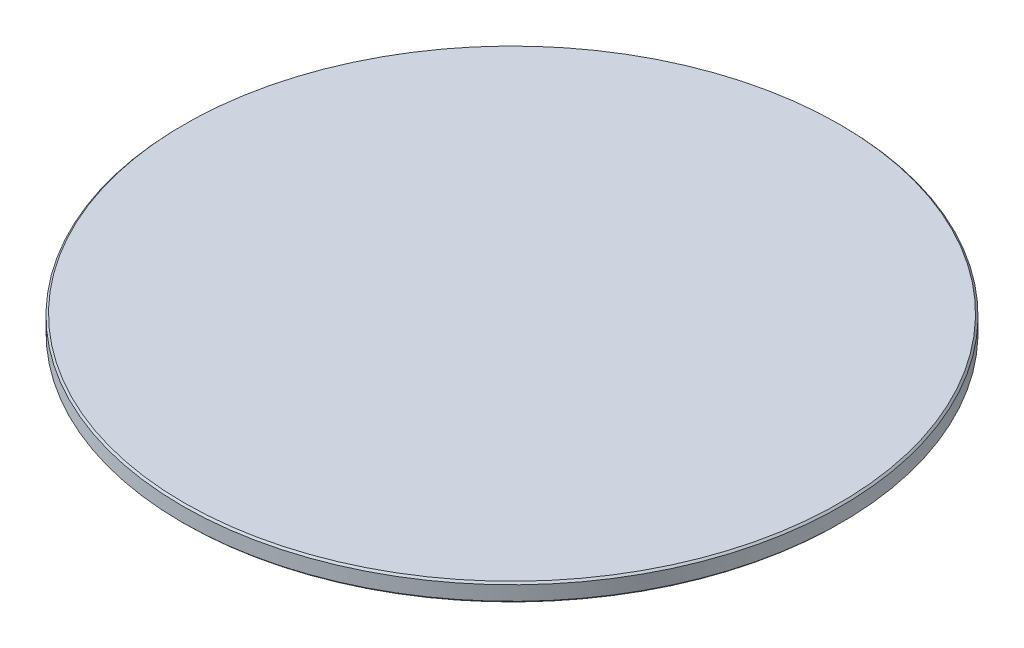
ISO-10303-21;
HEADER;
FILE_DESCRIPTION(('STEP AP214'),'2;1');
FILE_NAME('part.step','',(''),(''),'','','');
FILE_SCHEMA(('AUTOMOTIVE_DESIGN { 1 0 10303 214 1 1 1 1 }'));
ENDSEC;
DATA;
#1=APPLICATION_CONTEXT('core data for automotive mechanical design processes');
#2=APPLICATION_PROTOCOL_DEFINITION('international standard','automotive_design',2000,#1);
#3=PRODUCT_CONTEXT('',#1,'mechanical');
#4=PRODUCT('Part','Part','',(#3));
#5=PRODUCT_RELATED_PRODUCT_CATEGORY('part','',(#4));
#6=PRODUCT_DEFINITION_FORMATION('','',#4);
#7=PRODUCT_DEFINITION_CONTEXT('part definition',#1,'design');
#8=PRODUCT_DEFINITION('design','',#6,#7);
#9=PRODUCT_DEFINITION_SHAPE('','',#8);
#10=(LENGTH_UNIT() NAMED_UNIT(*) SI_UNIT(.MILLI.,.METRE.));
#11=(NAMED_UNIT(*) PLANE_ANGLE_UNIT() SI_UNIT($,.RADIAN.));
#12=(NAMED_UNIT(*) SI_UNIT($,.STERADIAN.) SOLID_ANGLE_UNIT());
#13=UNCERTAINTY_MEASURE_WITH_UNIT(LENGTH_MEASURE(1.E-05),#10,'distance_accuracy_value','');
#14=(GEOMETRIC_REPRESENTATION_CONTEXT(3) GLOBAL_UNCERTAINTY_ASSIGNED_CONTEXT((#13)) GLOBAL_UNIT_ASSIGNED_CONTEXT((#10,
#11,#12)) REPRESENTATION_CONTEXT('',''));
#15=CARTESIAN_POINT('',(0.,0.,0.));
#16=DIRECTION('',(0.,0.,1.));
#17=DIRECTION('',(1.,0.,0.));
#18=AXIS2_PLACEMENT_3D('',#15,#16,#17);
#19=CARTESIAN_POINT('',(0.,0.,0.));
#20=DIRECTION('',(0.,1.,0.));
#21=DIRECTION('',(0.,0.,1.));
#22=AXIS2_PLACEMENT_3D('',#19,#20,#21);
#23=PLANE('',#22);
#24=CARTESIAN_POINT('',(0.,0.,0.));
#25=DIRECTION('',(0.,1.,0.));
#26=DIRECTION('',(0.,0.,1.));
#27=AXIS2_PLACEMENT_3D('',#24,#25,#26);
#28=CIRCLE('',#27,91.5);
#29=CARTESIAN_POINT('',(0.,0.,91.5));
#30=VERTEX_POINT('',#29);
#31=EDGE_CURVE('E66',#30,#30,#28,.T.);
#32=ORIENTED_EDGE('',*,*,#31,.T.);
#33=EDGE_LOOP('',(#32));
#34=FACE_BOUND('',#33,.T.);
#35=ADVANCED_FACE('F31',(#34),#23,.T.);
#36=CARTESIAN_POINT('',(0.,-1.2,0.));
#37=DIRECTION('',(0.,-1.,0.));
#38=DIRECTION('',(0.,0.,-1.));
#39=AXIS2_PLACEMENT_3D('',#36,#37,#38);
#40=CYLINDRICAL_SURFACE('',#39,92.);
#41=CARTESIAN_POINT('',(0.,-0.5,0.));
#42=DIRECTION('',(0.,1.,0.));
#43=DIRECTION('',(0.,0.,1.));
#44=AXIS2_PLACEMENT_3D('',#41,#42,#43);
#45=CIRCLE('',#44,92.);
#46=CARTESIAN_POINT('',(0.,-0.5,92.));
#47=VERTEX_POINT('',#46);
#48=EDGE_CURVE('E69',#47,#47,#45,.F.);
#49=ORIENTED_EDGE('',*,*,#48,.T.);
#50=EDGE_LOOP('',(#49));
#51=FACE_BOUND('',#50,.T.);
#52=CARTESIAN_POINT('',(0.,-4.49999999999998,0.));
#53=DIRECTION('',(0.,-1.,0.));
#54=DIRECTION('',(0.,0.,-1.));
#55=AXIS2_PLACEMENT_3D('',#52,#53,#54);
#56=CIRCLE('',#55,92.);
#57=CARTESIAN_POINT('',(0.,-4.49999999999998,-92.));
#58=VERTEX_POINT('',#57);
#59=EDGE_CURVE('E72',#58,#58,#56,.F.);
#60=ORIENTED_EDGE('',*,*,#59,.T.);
#61=EDGE_LOOP('',(#60));
#62=FACE_BOUND('',#61,.T.);
#63=ADVANCED_FACE('F100',(#51,#62),#40,.T.);
#64=CARTESIAN_POINT('',(92.,-5.,0.));
#65=DIRECTION('',(0.,-1.,0.));
#66=DIRECTION('',(0.,0.,-1.));
#67=AXIS2_PLACEMENT_3D('',#64,#65,#66);
#68=PLANE('',#67);
#69=CARTESIAN_POINT('',(0.,-5.,0.));
#70=DIRECTION('',(0.,-1.,0.));
#71=DIRECTION('',(0.,0.,-1.));
#72=AXIS2_PLACEMENT_3D('',#69,#70,#71);
#73=CIRCLE('',#72,90.6);
#74=CARTESIAN_POINT('',(0.,-5.,-90.6));
#75=VERTEX_POINT('',#74);
#76=EDGE_CURVE('E10',#75,#75,#73,.F.);
#77=ORIENTED_EDGE('',*,*,#76,.T.);
#78=EDGE_LOOP('',(#77));
#79=FACE_BOUND('',#78,.T.);
#80=CARTESIAN_POINT('',(0.,-5.,0.));
#81=DIRECTION('',(0.,-1.,0.));
#82=DIRECTION('',(0.,0.,-1.));
#83=AXIS2_PLACEMENT_3D('',#80,#81,#82);
#84=CIRCLE('',#83,91.5);
#85=CARTESIAN_POINT('',(0.,-5.,-91.5));
#86=VERTEX_POINT('',#85);
#87=EDGE_CURVE('E38',#86,#86,#84,.T.);
#88=ORIENTED_EDGE('',*,*,#87,.T.);
#89=EDGE_LOOP('',(#88));
#90=FACE_BOUND('',#89,.T.);
#91=ADVANCED_FACE('F96',(#79,#90),#68,.T.);
#92=CARTESIAN_POINT('',(0.,-1.2,0.));
#93=DIRECTION('',(0.,-1.,0.));
#94=DIRECTION('',(0.,0.,-1.));
#95=AXIS2_PLACEMENT_3D('',#92,#93,#94);
#96=CYLINDRICAL_SURFACE('',#95,90.1);
#97=CARTESIAN_POINT('',(0.,-4.50000000000007,0.));
#98=DIRECTION('',(0.,-1.,0.));
#99=DIRECTION('',(0.,0.,-1.));
#100=AXIS2_PLACEMENT_3D('',#97,#98,#99);
#101=CIRCLE('',#100,90.1);
#102=CARTESIAN_POINT('',(0.,-4.50000000000007,-90.1));
#103=VERTEX_POINT('',#102);
#104=EDGE_CURVE('E42',#103,#103,#101,.T.);
#105=ORIENTED_EDGE('',*,*,#104,.T.);
#106=EDGE_LOOP('',(#105));
#107=FACE_BOUND('',#106,.T.);
#108=CARTESIAN_POINT('',(0.,-2.,0.));
#109=DIRECTION('',(0.,-1.,0.));
#110=DIRECTION('',(0.,0.,-1.));
#111=AXIS2_PLACEMENT_3D('',#108,#109,#110);
#112=CIRCLE('',#111,90.1);
#113=CARTESIAN_POINT('',(0.,-2.,-90.1));
#114=VERTEX_POINT('',#113);
#115=EDGE_CURVE('E75',#114,#114,#112,.T.);
#116=ORIENTED_EDGE('',*,*,#115,.F.);
#117=EDGE_LOOP('',(#116));
#118=FACE_BOUND('',#117,.T.);
#119=ADVANCED_FACE('F86',(#107,#118),#96,.F.);
#120=CARTESIAN_POINT('',(90.1,-2.,0.));
#121=DIRECTION('',(0.,-1.,0.));
#122=DIRECTION('',(0.,0.,-1.));
#123=AXIS2_PLACEMENT_3D('',#120,#121,#122);
#124=PLANE('',#123);
#125=ORIENTED_EDGE('',*,*,#115,.T.);
#126=EDGE_LOOP('',(#125));
#127=FACE_BOUND('',#126,.T.);
#128=CARTESIAN_POINT('',(0.,-2.,0.));
#129=DIRECTION('',(0.,-1.,0.));
#130=DIRECTION('',(0.,0.,-1.));
#131=AXIS2_PLACEMENT_3D('',#128,#129,#130);
#132=CIRCLE('',#131,84.9);
#133=CARTESIAN_POINT('',(0.,-2.,-84.9));
#134=VERTEX_POINT('',#133);
#135=EDGE_CURVE('E78',#134,#134,#132,.T.);
#136=ORIENTED_EDGE('',*,*,#135,.F.);
#137=EDGE_LOOP('',(#136));
#138=FACE_BOUND('',#137,.T.);
#139=ADVANCED_FACE('F84',(#127,#138),#124,.T.);
#140=CARTESIAN_POINT('',(0.,-1.2,0.));
#141=DIRECTION('',(0.,-1.,0.));
#142=DIRECTION('',(0.,0.,-1.));
#143=AXIS2_PLACEMENT_3D('',#140,#141,#142);
#144=CYLINDRICAL_SURFACE('',#143,84.9);
#145=CARTESIAN_POINT('',(0.,-4.49999999999996,0.));
#146=DIRECTION('',(0.,-1.,0.));
#147=DIRECTION('',(0.,0.,-1.));
#148=AXIS2_PLACEMENT_3D('',#145,#146,#147);
#149=CIRCLE('',#148,84.9);
#150=CARTESIAN_POINT('',(0.,-4.49999999999996,-84.9));
#151=VERTEX_POINT('',#150);
#152=EDGE_CURVE('E46',#151,#151,#149,.F.);
#153=ORIENTED_EDGE('',*,*,#152,.T.);
#154=EDGE_LOOP('',(#153));
#155=FACE_BOUND('',#154,.T.);
#156=ORIENTED_EDGE('',*,*,#135,.T.);
#157=EDGE_LOOP('',(#156));
#158=FACE_BOUND('',#157,.T.);
#159=ADVANCED_FACE('F82',(#155,#158),#144,.T.);
#160=CARTESIAN_POINT('',(84.9,-5.,0.));
#161=DIRECTION('',(0.,-1.,0.));
#162=DIRECTION('',(0.,0.,-1.));
#163=AXIS2_PLACEMENT_3D('',#160,#161,#162);
#164=PLANE('',#163);
#165=CARTESIAN_POINT('',(0.,-5.,0.));
#166=DIRECTION('',(0.,-1.,0.));
#167=DIRECTION('',(0.,0.,-1.));
#168=AXIS2_PLACEMENT_3D('',#165,#166,#167);
#169=CIRCLE('',#168,83.5);
#170=CARTESIAN_POINT('',(0.,-5.,-83.5));
#171=VERTEX_POINT('',#170);
#172=EDGE_CURVE('E51',#171,#171,#169,.F.);
#173=ORIENTED_EDGE('',*,*,#172,.T.);
#174=EDGE_LOOP('',(#173));
#175=FACE_BOUND('',#174,.T.);
#176=CARTESIAN_POINT('',(0.,-5.,0.));
#177=DIRECTION('',(0.,-1.,0.));
#178=DIRECTION('',(0.,0.,-1.));
#179=AXIS2_PLACEMENT_3D('',#176,#177,#178);
#180=CIRCLE('',#179,84.4);
#181=CARTESIAN_POINT('',(0.,-5.,-84.4));
#182=VERTEX_POINT('',#181);
#183=EDGE_CURVE('E54',#182,#182,#180,.T.);
#184=ORIENTED_EDGE('',*,*,#183,.T.);
#185=EDGE_LOOP('',(#184));
#186=FACE_BOUND('',#185,.T.);
#187=ADVANCED_FACE('F93',(#175,#186),#164,.T.);
#188=CARTESIAN_POINT('',(0.,-1.2,0.));
#189=DIRECTION('',(0.,-1.,0.));
#190=DIRECTION('',(0.,0.,-1.));
#191=AXIS2_PLACEMENT_3D('',#188,#189,#190);
#192=CYLINDRICAL_SURFACE('',#191,83.);
#193=CARTESIAN_POINT('',(0.,-1.69999999999994,0.));
#194=DIRECTION('',(0.,-1.,0.));
#195=DIRECTION('',(0.,0.,-1.));
#196=AXIS2_PLACEMENT_3D('',#193,#194,#195);
#197=CIRCLE('',#196,83.);
#198=CARTESIAN_POINT('',(0.,-1.69999999999994,-83.));
#199=VERTEX_POINT('',#198);
#200=EDGE_CURVE('E57',#199,#199,#197,.F.);
#201=ORIENTED_EDGE('',*,*,#200,.T.);
#202=EDGE_LOOP('',(#201));
#203=FACE_BOUND('',#202,.T.);
#204=CARTESIAN_POINT('',(0.,-4.50000000000003,0.));
#205=DIRECTION('',(0.,-1.,0.));
#206=DIRECTION('',(0.,0.,-1.));
#207=AXIS2_PLACEMENT_3D('',#204,#205,#206);
#208=CIRCLE('',#207,83.);
#209=CARTESIAN_POINT('',(0.,-4.50000000000003,-83.));
#210=VERTEX_POINT('',#209);
#211=EDGE_CURVE('E60',#210,#210,#208,.T.);
#212=ORIENTED_EDGE('',*,*,#211,.T.);
#213=EDGE_LOOP('',(#212));
#214=FACE_BOUND('',#213,.T.);
#215=ADVANCED_FACE('F179',(#203,#214),#192,.F.);
#216=CARTESIAN_POINT('',(83.,-1.19999999999999,0.));
#217=DIRECTION('',(0.,-1.,0.));
#218=DIRECTION('',(0.,0.,-1.));
#219=AXIS2_PLACEMENT_3D('',#216,#217,#218);
#220=PLANE('',#219);
#221=CARTESIAN_POINT('',(0.,-1.19999999999999,0.));
#222=DIRECTION('',(0.,-1.,0.));
#223=DIRECTION('',(0.,0.,-1.));
#224=AXIS2_PLACEMENT_3D('',#221,#222,#223);
#225=CIRCLE('',#224,82.5);
#226=CARTESIAN_POINT('',(0.,-1.19999999999999,-82.5));
#227=VERTEX_POINT('',#226);
#228=EDGE_CURVE('E63',#227,#227,#225,.T.);
#229=ORIENTED_EDGE('',*,*,#228,.T.);
#230=EDGE_LOOP('',(#229));
#231=FACE_BOUND('',#230,.T.);
#232=ADVANCED_FACE('F114',(#231),#220,.T.);
#233=CARTESIAN_POINT('',(0.,-0.5,0.));
#234=DIRECTION('',(0.,-1.,0.));
#235=DIRECTION('',(0.,0.,-1.));
#236=AXIS2_PLACEMENT_3D('',#233,#234,#235);
#237=CONICAL_SURFACE('',#236,92.,0.785398163397448);
#238=ORIENTED_EDGE('',*,*,#31,.F.);
#239=EDGE_LOOP('',(#238));
#240=FACE_BOUND('',#239,.T.);
#241=ORIENTED_EDGE('',*,*,#48,.F.);
#242=EDGE_LOOP('',(#241));
#243=FACE_BOUND('',#242,.T.);
#244=ADVANCED_FACE('F110',(#240,#243),#237,.T.);
#245=CARTESIAN_POINT('',(0.,-1.19999999999999,0.));
#246=DIRECTION('',(0.,-1.,0.));
#247=DIRECTION('',(0.,0.,-1.));
#248=AXIS2_PLACEMENT_3D('',#245,#246,#247);
#249=CONICAL_SURFACE('',#248,82.5,0.78539816339749);
#250=ORIENTED_EDGE('',*,*,#200,.F.);
#251=EDGE_LOOP('',(#250));
#252=FACE_BOUND('',#251,.T.);
#253=ORIENTED_EDGE('',*,*,#228,.F.);
#254=EDGE_LOOP('',(#253));
#255=FACE_BOUND('',#254,.T.);
#256=ADVANCED_FACE('F113',(#252,#255),#249,.F.);
#257=CARTESIAN_POINT('',(0.,-4.50000000000003,0.));
#258=DIRECTION('',(0.,-1.,0.));
#259=DIRECTION('',(0.,0.,-1.));
#260=AXIS2_PLACEMENT_3D('',#257,#258,#259);
#261=CONICAL_SURFACE('',#260,83.,0.785398163397462);
#262=ORIENTED_EDGE('',*,*,#172,.F.);
#263=EDGE_LOOP('',(#262));
#264=FACE_BOUND('',#263,.T.);
#265=ORIENTED_EDGE('',*,*,#211,.F.);
#266=EDGE_LOOP('',(#265));
#267=FACE_BOUND('',#266,.T.);
#268=ADVANCED_FACE('F118',(#264,#267),#261,.F.);
#269=CARTESIAN_POINT('',(0.,-5.,0.));
#270=DIRECTION('',(0.,1.,0.));
#271=DIRECTION('',(0.,0.,1.));
#272=AXIS2_PLACEMENT_3D('',#269,#270,#271);
#273=CONICAL_SURFACE('',#272,84.4,0.785398163397407);
#274=ORIENTED_EDGE('',*,*,#152,.F.);
#275=EDGE_LOOP('',(#274));
#276=FACE_BOUND('',#275,.T.);
#277=ORIENTED_EDGE('',*,*,#183,.F.);
#278=EDGE_LOOP('',(#277));
#279=FACE_BOUND('',#278,.T.);
#280=ADVANCED_FACE('F122',(#276,#279),#273,.T.);
#281=CARTESIAN_POINT('',(0.,-4.50000000000007,0.));
#282=DIRECTION('',(0.,-1.,0.));
#283=DIRECTION('',(0.,0.,-1.));
#284=AXIS2_PLACEMENT_3D('',#281,#282,#283);
#285=CONICAL_SURFACE('',#284,90.1,0.78539816339749);
#286=ORIENTED_EDGE('',*,*,#76,.F.);
#287=EDGE_LOOP('',(#286));
#288=FACE_BOUND('',#287,.T.);
#289=ORIENTED_EDGE('',*,*,#104,.F.);
#290=EDGE_LOOP('',(#289));
#291=FACE_BOUND('',#290,.T.);
#292=ADVANCED_FACE('F125',(#288,#291),#285,.F.);
#293=CARTESIAN_POINT('',(0.,-5.,0.));
#294=DIRECTION('',(0.,1.,0.));
#295=DIRECTION('',(0.,0.,1.));
#296=AXIS2_PLACEMENT_3D('',#293,#294,#295);
#297=CONICAL_SURFACE('',#296,91.5,0.785398163397435);
#298=ORIENTED_EDGE('',*,*,#59,.F.);
#299=EDGE_LOOP('',(#298));
#300=FACE_BOUND('',#299,.T.);
#301=ORIENTED_EDGE('',*,*,#87,.F.);
#302=EDGE_LOOP('',(#301));
#303=FACE_BOUND('',#302,.T.);
#304=ADVANCED_FACE('F33',(#300,#303),#297,.T.);
#305=CLOSED_SHELL('',(#35,#63,#91,#119,#139,#159,#187,#215,#232,#244,#256,#268,#280,#292,#304));
#306=MANIFOLD_SOLID_BREP('B2',#305);
#307=ADVANCED_BREP_SHAPE_REPRESENTATION('',(#18,#306),#14);
#308=SHAPE_DEFINITION_REPRESENTATION(#9,#307);
ENDSEC;
END-ISO-10303-21;
